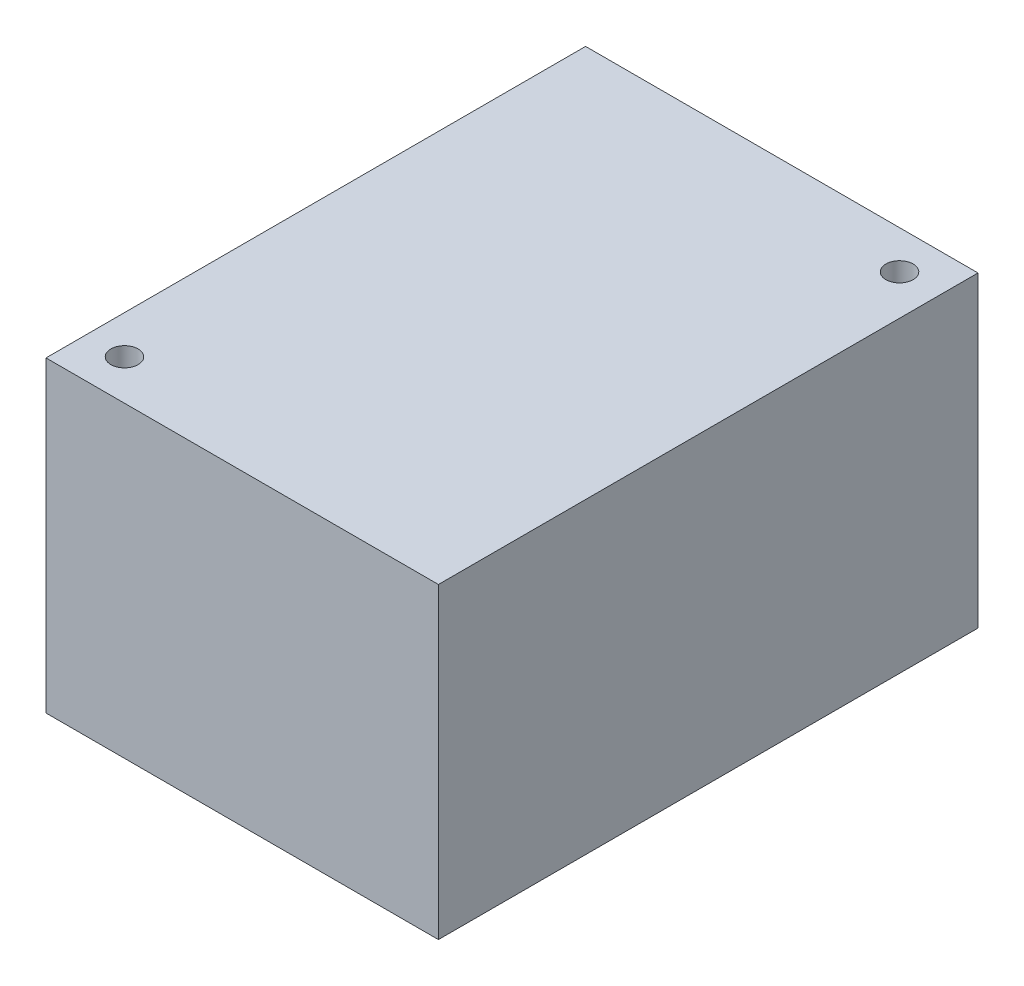
ISO-10303-21;
HEADER;
FILE_DESCRIPTION(('STEP AP214'),'2;1');
FILE_NAME('part.step','',(''),(''),'','','');
FILE_SCHEMA(('AUTOMOTIVE_DESIGN { 1 0 10303 214 1 1 1 1 }'));
ENDSEC;
DATA;
#1=APPLICATION_CONTEXT('core data for automotive mechanical design processes');
#2=APPLICATION_PROTOCOL_DEFINITION('international standard','automotive_design',2000,#1);
#3=PRODUCT_CONTEXT('',#1,'mechanical');
#4=PRODUCT('Part','Part','',(#3));
#5=PRODUCT_RELATED_PRODUCT_CATEGORY('part','',(#4));
#6=PRODUCT_DEFINITION_FORMATION('','',#4);
#7=PRODUCT_DEFINITION_CONTEXT('part definition',#1,'design');
#8=PRODUCT_DEFINITION('design','',#6,#7);
#9=PRODUCT_DEFINITION_SHAPE('','',#8);
#10=(LENGTH_UNIT() NAMED_UNIT(*) SI_UNIT(.MILLI.,.METRE.));
#11=(NAMED_UNIT(*) PLANE_ANGLE_UNIT() SI_UNIT($,.RADIAN.));
#12=(NAMED_UNIT(*) SI_UNIT($,.STERADIAN.) SOLID_ANGLE_UNIT());
#13=UNCERTAINTY_MEASURE_WITH_UNIT(LENGTH_MEASURE(1.E-05),#10,'distance_accuracy_value','');
#14=(GEOMETRIC_REPRESENTATION_CONTEXT(3) GLOBAL_UNCERTAINTY_ASSIGNED_CONTEXT((#13)) GLOBAL_UNIT_ASSIGNED_CONTEXT((#10,
#11,#12)) REPRESENTATION_CONTEXT('',''));
#15=CARTESIAN_POINT('',(0.,0.,0.));
#16=DIRECTION('',(0.,0.,1.));
#17=DIRECTION('',(1.,0.,0.));
#18=AXIS2_PLACEMENT_3D('',#15,#16,#17);
#19=CARTESIAN_POINT('',(39.9364944118695,290.851766130372,209.944134902481));
#20=DIRECTION('',(1.,0.,0.));
#21=DIRECTION('',(0.,0.,-1.));
#22=AXIS2_PLACEMENT_3D('',#19,#20,#21);
#23=PLANE('',#22);
#24=DIRECTION('',(0.,0.,1.));
#25=VECTOR('',#24,1.);
#26=CARTESIAN_POINT('',(39.9364944118695,222.844413586695,209.944134902481));
#27=LINE('',#26,#25);
#28=CARTESIAN_POINT('',(39.9364944118695,222.844413586695,182.544134902481));
#29=VERTEX_POINT('',#28);
#30=CARTESIAN_POINT('',(39.9364944118695,222.844413586695,237.544134902481));
#31=VERTEX_POINT('',#30);
#32=EDGE_CURVE('E83',#29,#31,#27,.T.);
#33=ORIENTED_EDGE('',*,*,#32,.F.);
#34=DIRECTION('',(0.,-1.,0.));
#35=VECTOR('',#34,1.);
#36=CARTESIAN_POINT('',(39.9364944118695,290.851766130372,182.544134902481));
#37=LINE('',#36,#35);
#38=CARTESIAN_POINT('',(39.9364944118695,191.494413586695,182.544134902481));
#39=VERTEX_POINT('',#38);
#40=EDGE_CURVE('E37',#29,#39,#37,.T.);
#41=ORIENTED_EDGE('',*,*,#40,.T.);
#42=DIRECTION('',(0.,0.,1.));
#43=VECTOR('',#42,1.);
#44=CARTESIAN_POINT('',(39.9364944118695,191.494413586695,209.944134902481));
#45=LINE('',#44,#43);
#46=CARTESIAN_POINT('',(39.9364944118695,191.494413586695,237.544134902481));
#47=VERTEX_POINT('',#46);
#48=EDGE_CURVE('E81',#39,#47,#45,.T.);
#49=ORIENTED_EDGE('',*,*,#48,.T.);
#50=DIRECTION('',(0.,-1.,0.));
#51=VECTOR('',#50,1.);
#52=CARTESIAN_POINT('',(39.9364944118695,290.851766130372,237.544134902481));
#53=LINE('',#52,#51);
#54=EDGE_CURVE('E72',#31,#47,#53,.T.);
#55=ORIENTED_EDGE('',*,*,#54,.F.);
#56=EDGE_LOOP('',(#33,#41,#49,#55));
#57=FACE_BOUND('',#56,.T.);
#58=ADVANCED_FACE('F33',(#57),#23,.F.);
#59=CARTESIAN_POINT('',(59.8364944118695,290.851766130372,237.544134902481));
#60=DIRECTION('',(0.,0.,-1.));
#61=DIRECTION('',(-1.,0.,0.));
#62=AXIS2_PLACEMENT_3D('',#59,#60,#61);
#63=PLANE('',#62);
#64=DIRECTION('',(1.,0.,0.));
#65=VECTOR('',#64,1.);
#66=CARTESIAN_POINT('',(59.8364944118695,222.844413586695,237.544134902481));
#67=LINE('',#66,#65);
#68=CARTESIAN_POINT('',(79.9364944118694,222.844413586695,237.544134902481));
#69=VERTEX_POINT('',#68);
#70=EDGE_CURVE('E42',#31,#69,#67,.T.);
#71=ORIENTED_EDGE('',*,*,#70,.F.);
#72=ORIENTED_EDGE('',*,*,#54,.T.);
#73=DIRECTION('',(1.,0.,0.));
#74=VECTOR('',#73,1.);
#75=CARTESIAN_POINT('',(59.8364944118695,191.494413586695,237.544134902481));
#76=LINE('',#75,#74);
#77=CARTESIAN_POINT('',(79.9364944118694,191.494413586695,237.544134902481));
#78=VERTEX_POINT('',#77);
#79=EDGE_CURVE('E94',#47,#78,#76,.T.);
#80=ORIENTED_EDGE('',*,*,#79,.T.);
#81=DIRECTION('',(0.,-1.,0.));
#82=VECTOR('',#81,1.);
#83=CARTESIAN_POINT('',(79.9364944118694,290.851766130372,237.544134902481));
#84=LINE('',#83,#82);
#85=EDGE_CURVE('E103',#69,#78,#84,.T.);
#86=ORIENTED_EDGE('',*,*,#85,.F.);
#87=EDGE_LOOP('',(#71,#72,#80,#86));
#88=FACE_BOUND('',#87,.T.);
#89=ADVANCED_FACE('F139',(#88),#63,.F.);
#90=CARTESIAN_POINT('',(79.9364944118694,290.851766130372,209.944134902481));
#91=DIRECTION('',(-1.,0.,0.));
#92=DIRECTION('',(0.,0.,1.));
#93=AXIS2_PLACEMENT_3D('',#90,#91,#92);
#94=PLANE('',#93);
#95=DIRECTION('',(0.,0.,-1.));
#96=VECTOR('',#95,1.);
#97=CARTESIAN_POINT('',(79.9364944118694,222.844413586695,209.944134902481));
#98=LINE('',#97,#96);
#99=CARTESIAN_POINT('',(79.9364944118694,222.844413586695,182.544134902481));
#100=VERTEX_POINT('',#99);
#101=EDGE_CURVE('E11',#69,#100,#98,.T.);
#102=ORIENTED_EDGE('',*,*,#101,.F.);
#103=ORIENTED_EDGE('',*,*,#85,.T.);
#104=DIRECTION('',(0.,0.,-1.));
#105=VECTOR('',#104,1.);
#106=CARTESIAN_POINT('',(79.9364944118694,191.494413586695,209.944134902481));
#107=LINE('',#106,#105);
#108=CARTESIAN_POINT('',(79.9364944118694,191.494413586695,182.544134902481));
#109=VERTEX_POINT('',#108);
#110=EDGE_CURVE('E104',#78,#109,#107,.T.);
#111=ORIENTED_EDGE('',*,*,#110,.T.);
#112=DIRECTION('',(0.,-1.,0.));
#113=VECTOR('',#112,1.);
#114=CARTESIAN_POINT('',(79.9364944118694,290.851766130372,182.544134902481));
#115=LINE('',#114,#113);
#116=EDGE_CURVE('E55',#100,#109,#115,.T.);
#117=ORIENTED_EDGE('',*,*,#116,.F.);
#118=EDGE_LOOP('',(#102,#103,#111,#117));
#119=FACE_BOUND('',#118,.T.);
#120=ADVANCED_FACE('F143',(#119),#94,.F.);
#121=CARTESIAN_POINT('',(59.8364944118695,290.851766130372,182.544134902481));
#122=DIRECTION('',(0.,0.,1.));
#123=DIRECTION('',(1.,0.,0.));
#124=AXIS2_PLACEMENT_3D('',#121,#122,#123);
#125=PLANE('',#124);
#126=DIRECTION('',(-1.,0.,0.));
#127=VECTOR('',#126,1.);
#128=CARTESIAN_POINT('',(59.8364944118695,222.844413586695,182.544134902481));
#129=LINE('',#128,#127);
#130=EDGE_CURVE('E91',#100,#29,#129,.T.);
#131=ORIENTED_EDGE('',*,*,#130,.F.);
#132=ORIENTED_EDGE('',*,*,#116,.T.);
#133=DIRECTION('',(-1.,0.,0.));
#134=VECTOR('',#133,1.);
#135=CARTESIAN_POINT('',(59.8364944118695,191.494413586695,182.544134902481));
#136=LINE('',#135,#134);
#137=EDGE_CURVE('E87',#109,#39,#136,.T.);
#138=ORIENTED_EDGE('',*,*,#137,.T.);
#139=ORIENTED_EDGE('',*,*,#40,.F.);
#140=EDGE_LOOP('',(#131,#132,#138,#139));
#141=FACE_BOUND('',#140,.T.);
#142=ADVANCED_FACE('F88',(#141),#125,.F.);
#143=CARTESIAN_POINT('',(0.,191.494413586695,0.));
#144=DIRECTION('',(0.,1.,0.));
#145=DIRECTION('',(0.,0.,1.));
#146=AXIS2_PLACEMENT_3D('',#143,#144,#145);
#147=PLANE('',#146);
#148=CARTESIAN_POINT('',(75.8364944118695,191.494413586695,186.444134902481));
#149=DIRECTION('',(0.,-1.,0.));
#150=DIRECTION('',(0.,0.,-1.));
#151=AXIS2_PLACEMENT_3D('',#148,#149,#150);
#152=CIRCLE('',#151,1.38912599999999);
#153=CARTESIAN_POINT('',(75.8364944118695,191.494413586695,185.055008902481));
#154=VERTEX_POINT('',#153);
#155=EDGE_CURVE('E115',#154,#154,#152,.T.);
#156=ORIENTED_EDGE('',*,*,#155,.F.);
#157=EDGE_LOOP('',(#156));
#158=FACE_BOUND('',#157,.T.);
#159=CARTESIAN_POINT('',(43.8364944118695,191.494413586695,233.444134902481));
#160=DIRECTION('',(0.,-1.,0.));
#161=DIRECTION('',(0.,0.,-1.));
#162=AXIS2_PLACEMENT_3D('',#159,#160,#161);
#163=CIRCLE('',#162,1.389126);
#164=CARTESIAN_POINT('',(43.8364944118695,191.494413586695,232.055008902481));
#165=VERTEX_POINT('',#164);
#166=EDGE_CURVE('E109',#165,#165,#163,.T.);
#167=ORIENTED_EDGE('',*,*,#166,.F.);
#168=EDGE_LOOP('',(#167));
#169=FACE_BOUND('',#168,.T.);
#170=ORIENTED_EDGE('',*,*,#48,.F.);
#171=ORIENTED_EDGE('',*,*,#137,.F.);
#172=ORIENTED_EDGE('',*,*,#110,.F.);
#173=ORIENTED_EDGE('',*,*,#79,.F.);
#174=EDGE_LOOP('',(#170,#171,#172,#173));
#175=FACE_BOUND('',#174,.T.);
#176=ADVANCED_FACE('F93',(#158,#169,#175),#147,.F.);
#177=CARTESIAN_POINT('',(68.6864944118695,222.844413586695,224.839134902481));
#178=DIRECTION('',(0.,1.,0.));
#179=DIRECTION('',(0.,0.,-1.));
#180=AXIS2_PLACEMENT_3D('',#177,#178,#179);
#181=PLANE('',#180);
#182=CARTESIAN_POINT('',(75.8364944118695,222.844413586695,186.444134902481));
#183=DIRECTION('',(0.,-1.,0.));
#184=DIRECTION('',(0.,0.,-1.));
#185=AXIS2_PLACEMENT_3D('',#182,#183,#184);
#186=CIRCLE('',#185,1.38912599999999);
#187=CARTESIAN_POINT('',(75.8364944118695,222.844413586695,185.055008902481));
#188=VERTEX_POINT('',#187);
#189=EDGE_CURVE('E112',#188,#188,#186,.T.);
#190=ORIENTED_EDGE('',*,*,#189,.T.);
#191=EDGE_LOOP('',(#190));
#192=FACE_BOUND('',#191,.T.);
#193=CARTESIAN_POINT('',(43.8364944118695,222.844413586695,233.444134902481));
#194=DIRECTION('',(0.,-1.,0.));
#195=DIRECTION('',(0.,0.,-1.));
#196=AXIS2_PLACEMENT_3D('',#193,#194,#195);
#197=CIRCLE('',#196,1.38912599999999);
#198=CARTESIAN_POINT('',(43.8364944118695,222.844413586695,232.055008902481));
#199=VERTEX_POINT('',#198);
#200=EDGE_CURVE('E85',#199,#199,#197,.T.);
#201=ORIENTED_EDGE('',*,*,#200,.T.);
#202=EDGE_LOOP('',(#201));
#203=FACE_BOUND('',#202,.T.);
#204=ORIENTED_EDGE('',*,*,#130,.T.);
#205=ORIENTED_EDGE('',*,*,#32,.T.);
#206=ORIENTED_EDGE('',*,*,#70,.T.);
#207=ORIENTED_EDGE('',*,*,#101,.T.);
#208=EDGE_LOOP('',(#204,#205,#206,#207));
#209=FACE_BOUND('',#208,.T.);
#210=ADVANCED_FACE('F35',(#192,#203,#209),#181,.T.);
#211=CARTESIAN_POINT('',(43.8364944118695,191.494413586695,233.444134902481));
#212=DIRECTION('',(0.,-1.,0.));
#213=DIRECTION('',(0.,0.,-1.));
#214=AXIS2_PLACEMENT_3D('',#211,#212,#213);
#215=CYLINDRICAL_SURFACE('',#214,1.38912599999999);
#216=ORIENTED_EDGE('',*,*,#200,.F.);
#217=EDGE_LOOP('',(#216));
#218=FACE_BOUND('',#217,.T.);
#219=ORIENTED_EDGE('',*,*,#166,.T.);
#220=EDGE_LOOP('',(#219));
#221=FACE_BOUND('',#220,.T.);
#222=ADVANCED_FACE('F126',(#218,#221),#215,.F.);
#223=CARTESIAN_POINT('',(75.8364944118695,191.494413586695,186.444134902481));
#224=DIRECTION('',(0.,-1.,0.));
#225=DIRECTION('',(0.,0.,-1.));
#226=AXIS2_PLACEMENT_3D('',#223,#224,#225);
#227=CYLINDRICAL_SURFACE('',#226,1.38912599999999);
#228=ORIENTED_EDGE('',*,*,#189,.F.);
#229=EDGE_LOOP('',(#228));
#230=FACE_BOUND('',#229,.T.);
#231=ORIENTED_EDGE('',*,*,#155,.T.);
#232=EDGE_LOOP('',(#231));
#233=FACE_BOUND('',#232,.T.);
#234=ADVANCED_FACE('F119',(#230,#233),#227,.F.);
#235=CLOSED_SHELL('',(#58,#89,#120,#142,#176,#210,#222,#234));
#236=MANIFOLD_SOLID_BREP('B2',#235);
#237=ADVANCED_BREP_SHAPE_REPRESENTATION('',(#18,#236),#14);
#238=SHAPE_DEFINITION_REPRESENTATION(#9,#237);
ENDSEC;
END-ISO-10303-21;
